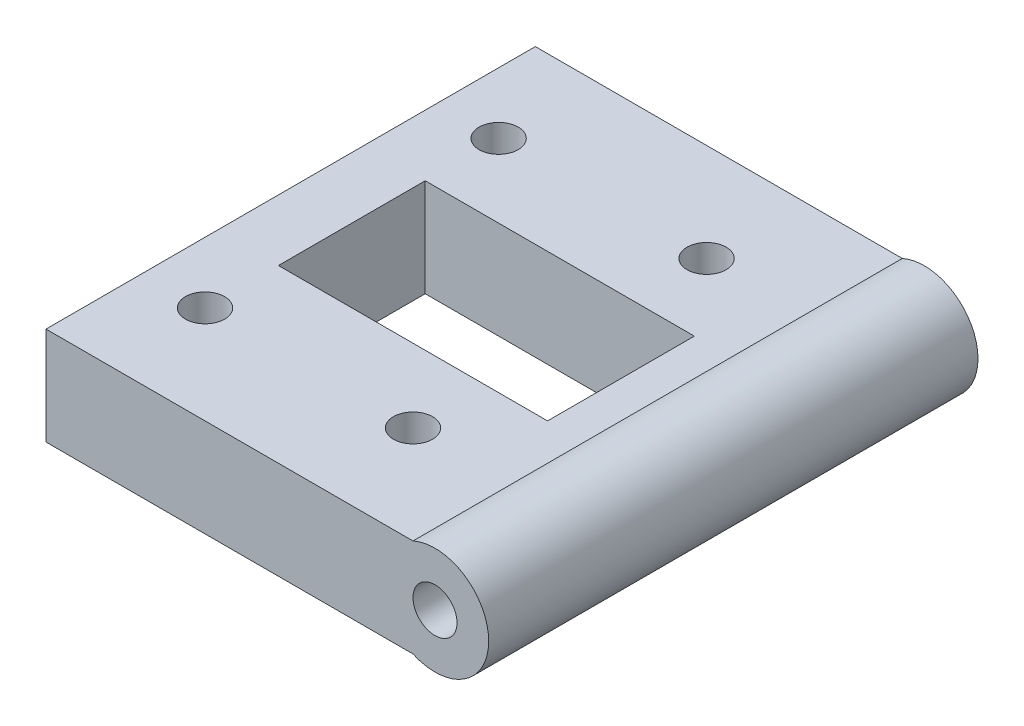
ISO-10303-21;
HEADER;
FILE_DESCRIPTION(('STEP AP214'),'2;1');
FILE_NAME('part.step','',(''),(''),'','','');
FILE_SCHEMA(('AUTOMOTIVE_DESIGN { 1 0 10303 214 1 1 1 1 }'));
ENDSEC;
DATA;
#1=APPLICATION_CONTEXT('core data for automotive mechanical design processes');
#2=APPLICATION_PROTOCOL_DEFINITION('international standard','automotive_design',2000,#1);
#3=PRODUCT_CONTEXT('',#1,'mechanical');
#4=PRODUCT('Part','Part','',(#3));
#5=PRODUCT_RELATED_PRODUCT_CATEGORY('part','',(#4));
#6=PRODUCT_DEFINITION_FORMATION('','',#4);
#7=PRODUCT_DEFINITION_CONTEXT('part definition',#1,'design');
#8=PRODUCT_DEFINITION('design','',#6,#7);
#9=PRODUCT_DEFINITION_SHAPE('','',#8);
#10=(LENGTH_UNIT() NAMED_UNIT(*) SI_UNIT(.MILLI.,.METRE.));
#11=(NAMED_UNIT(*) PLANE_ANGLE_UNIT() SI_UNIT($,.RADIAN.));
#12=(NAMED_UNIT(*) SI_UNIT($,.STERADIAN.) SOLID_ANGLE_UNIT());
#13=UNCERTAINTY_MEASURE_WITH_UNIT(LENGTH_MEASURE(1.E-05),#10,'distance_accuracy_value','');
#14=(GEOMETRIC_REPRESENTATION_CONTEXT(3) GLOBAL_UNCERTAINTY_ASSIGNED_CONTEXT((#13)) GLOBAL_UNIT_ASSIGNED_CONTEXT((#10,
#11,#12)) REPRESENTATION_CONTEXT('',''));
#15=CARTESIAN_POINT('',(0.,0.,0.));
#16=DIRECTION('',(0.,0.,1.));
#17=DIRECTION('',(1.,0.,0.));
#18=AXIS2_PLACEMENT_3D('',#15,#16,#17);
#19=CARTESIAN_POINT('',(21.3694771601507,8.,22.0463712196421));
#20=DIRECTION('',(1.,0.,0.));
#21=DIRECTION('',(0.,0.,-1.));
#22=AXIS2_PLACEMENT_3D('',#19,#20,#21);
#23=PLANE('',#22);
#24=DIRECTION('',(0.,0.,1.));
#25=VECTOR('',#24,1.);
#26=CARTESIAN_POINT('',(21.3694771601507,0.,22.0463712196421));
#27=LINE('',#26,#25);
#28=CARTESIAN_POINT('',(21.3694771601507,0.,-17.9536287803579));
#29=VERTEX_POINT('',#28);
#30=CARTESIAN_POINT('',(21.3694771601507,0.,22.0463712196421));
#31=VERTEX_POINT('',#30);
#32=EDGE_CURVE('E173',#29,#31,#27,.T.);
#33=ORIENTED_EDGE('',*,*,#32,.T.);
#34=DIRECTION('',(0.,-1.,0.));
#35=VECTOR('',#34,1.);
#36=CARTESIAN_POINT('',(21.3694771601507,8.,22.0463712196421));
#37=LINE('',#36,#35);
#38=CARTESIAN_POINT('',(21.3694771601507,8.,22.0463712196421));
#39=VERTEX_POINT('',#38);
#40=EDGE_CURVE('E207',#39,#31,#37,.T.);
#41=ORIENTED_EDGE('',*,*,#40,.F.);
#42=DIRECTION('',(0.,0.,1.));
#43=VECTOR('',#42,1.);
#44=CARTESIAN_POINT('',(21.3694771601507,8.,22.0463712196421));
#45=LINE('',#44,#43);
#46=CARTESIAN_POINT('',(21.3694771601507,8.,-17.9536287803579));
#47=VERTEX_POINT('',#46);
#48=EDGE_CURVE('E177',#47,#39,#45,.T.);
#49=ORIENTED_EDGE('',*,*,#48,.F.);
#50=DIRECTION('',(0.,-1.,0.));
#51=VECTOR('',#50,1.);
#52=CARTESIAN_POINT('',(21.3694771601507,8.,-17.9536287803579));
#53=LINE('',#52,#51);
#54=EDGE_CURVE('E191',#47,#29,#53,.T.);
#55=ORIENTED_EDGE('',*,*,#54,.T.);
#56=EDGE_LOOP('',(#33,#41,#49,#55));
#57=FACE_BOUND('',#56,.T.);
#58=ADVANCED_FACE('F42',(#57),#23,.F.);
#59=CARTESIAN_POINT('',(51.3694771601507,8.,22.0463712196421));
#60=DIRECTION('',(0.,0.,-1.));
#61=DIRECTION('',(-1.,0.,0.));
#62=AXIS2_PLACEMENT_3D('',#59,#60,#61);
#63=PLANE('',#62);
#64=DIRECTION('',(1.,0.,0.));
#65=VECTOR('',#64,1.);
#66=CARTESIAN_POINT('',(51.3694771601507,0.,22.0463712196421));
#67=LINE('',#66,#65);
#68=CARTESIAN_POINT('',(51.3694771601507,0.,22.0463712196421));
#69=VERTEX_POINT('',#68);
#70=EDGE_CURVE('E195',#31,#69,#67,.T.);
#71=ORIENTED_EDGE('',*,*,#70,.T.);
#72=CARTESIAN_POINT('',(53.1694771601507,4.,22.0463712196421));
#73=DIRECTION('',(0.,0.,1.));
#74=DIRECTION('',(1.,0.,0.));
#75=AXIS2_PLACEMENT_3D('',#72,#73,#74);
#76=CIRCLE('',#75,4.38634243989227);
#77=CARTESIAN_POINT('',(51.3694771601507,8.,22.0463712196421));
#78=VERTEX_POINT('',#77);
#79=EDGE_CURVE('E163',#69,#78,#76,.T.);
#80=ORIENTED_EDGE('',*,*,#79,.T.);
#81=DIRECTION('',(1.,0.,0.));
#82=VECTOR('',#81,1.);
#83=CARTESIAN_POINT('',(51.3694771601507,8.,22.0463712196421));
#84=LINE('',#83,#82);
#85=EDGE_CURVE('E181',#39,#78,#84,.T.);
#86=ORIENTED_EDGE('',*,*,#85,.F.);
#87=ORIENTED_EDGE('',*,*,#40,.T.);
#88=EDGE_LOOP('',(#71,#80,#86,#87));
#89=FACE_BOUND('',#88,.T.);
#90=CARTESIAN_POINT('',(53.1694771601507,4.,22.0463712196421));
#91=DIRECTION('',(0.,0.,1.));
#92=DIRECTION('',(1.,0.,0.));
#93=AXIS2_PLACEMENT_3D('',#90,#91,#92);
#94=CIRCLE('',#93,1.8);
#95=CARTESIAN_POINT('',(54.9694771601507,4.,22.0463712196421));
#96=VERTEX_POINT('',#95);
#97=EDGE_CURVE('E164',#96,#96,#94,.T.);
#98=ORIENTED_EDGE('',*,*,#97,.F.);
#99=EDGE_LOOP('',(#98));
#100=FACE_BOUND('',#99,.T.);
#101=ADVANCED_FACE('F252',(#89,#100),#63,.F.);
#102=CARTESIAN_POINT('',(51.3694771601507,8.,-17.9536287803579));
#103=DIRECTION('',(0.,0.,1.));
#104=DIRECTION('',(1.,0.,0.));
#105=AXIS2_PLACEMENT_3D('',#102,#103,#104);
#106=PLANE('',#105);
#107=CARTESIAN_POINT('',(53.1694771601507,4.,-17.9536287803579));
#108=DIRECTION('',(0.,0.,1.));
#109=DIRECTION('',(1.,0.,0.));
#110=AXIS2_PLACEMENT_3D('',#107,#108,#109);
#111=CIRCLE('',#110,1.8);
#112=CARTESIAN_POINT('',(54.9694771601507,4.,-17.9536287803579));
#113=VERTEX_POINT('',#112);
#114=EDGE_CURVE('E159',#113,#113,#111,.T.);
#115=ORIENTED_EDGE('',*,*,#114,.T.);
#116=EDGE_LOOP('',(#115));
#117=FACE_BOUND('',#116,.T.);
#118=DIRECTION('',(-1.,0.,0.));
#119=VECTOR('',#118,1.);
#120=CARTESIAN_POINT('',(51.3694771601507,8.,-17.9536287803579));
#121=LINE('',#120,#119);
#122=CARTESIAN_POINT('',(51.3694771601507,8.,-17.9536287803579));
#123=VERTEX_POINT('',#122);
#124=EDGE_CURVE('E188',#123,#47,#121,.T.);
#125=ORIENTED_EDGE('',*,*,#124,.F.);
#126=CARTESIAN_POINT('',(53.1694771601507,4.,-17.9536287803579));
#127=DIRECTION('',(0.,0.,1.));
#128=DIRECTION('',(1.,0.,0.));
#129=AXIS2_PLACEMENT_3D('',#126,#127,#128);
#130=CIRCLE('',#129,4.38634243989227);
#131=CARTESIAN_POINT('',(51.3694771601507,0.,-17.9536287803579));
#132=VERTEX_POINT('',#131);
#133=EDGE_CURVE('E169',#132,#123,#130,.T.);
#134=ORIENTED_EDGE('',*,*,#133,.F.);
#135=DIRECTION('',(-1.,0.,0.));
#136=VECTOR('',#135,1.);
#137=CARTESIAN_POINT('',(51.3694771601507,0.,-17.9536287803579));
#138=LINE('',#137,#136);
#139=EDGE_CURVE('E182',#132,#29,#138,.T.);
#140=ORIENTED_EDGE('',*,*,#139,.T.);
#141=ORIENTED_EDGE('',*,*,#54,.F.);
#142=EDGE_LOOP('',(#125,#134,#140,#141));
#143=FACE_BOUND('',#142,.T.);
#144=ADVANCED_FACE('F257',(#117,#143),#106,.F.);
#145=CARTESIAN_POINT('',(0.,8.,0.));
#146=DIRECTION('',(0.,1.,0.));
#147=DIRECTION('',(0.,0.,1.));
#148=AXIS2_PLACEMENT_3D('',#145,#146,#147);
#149=PLANE('',#148);
#150=DIRECTION('',(0.,0.,1.));
#151=VECTOR('',#150,1.);
#152=CARTESIAN_POINT('',(26.3694771601507,8.,8.04637121964206));
#153=LINE('',#152,#151);
#154=CARTESIAN_POINT('',(26.3694771601507,8.,-3.95362878035794));
#155=VERTEX_POINT('',#154);
#156=CARTESIAN_POINT('',(26.3694771601507,8.,8.04637121964206));
#157=VERTEX_POINT('',#156);
#158=EDGE_CURVE('E57',#155,#157,#153,.T.);
#159=ORIENTED_EDGE('',*,*,#158,.F.);
#160=DIRECTION('',(-1.,0.,0.));
#161=VECTOR('',#160,1.);
#162=CARTESIAN_POINT('',(48.3694771601507,8.,-3.95362878035794));
#163=LINE('',#162,#161);
#164=CARTESIAN_POINT('',(48.3694771601507,8.,-3.95362878035794));
#165=VERTEX_POINT('',#164);
#166=EDGE_CURVE('E128',#165,#155,#163,.T.);
#167=ORIENTED_EDGE('',*,*,#166,.F.);
#168=DIRECTION('',(0.,0.,-1.));
#169=VECTOR('',#168,1.);
#170=CARTESIAN_POINT('',(48.3694771601507,8.,8.04637121964206));
#171=LINE('',#170,#169);
#172=CARTESIAN_POINT('',(48.3694771601507,8.,8.04637121964206));
#173=VERTEX_POINT('',#172);
#174=EDGE_CURVE('E110',#173,#165,#171,.T.);
#175=ORIENTED_EDGE('',*,*,#174,.F.);
#176=DIRECTION('',(1.,0.,0.));
#177=VECTOR('',#176,1.);
#178=CARTESIAN_POINT('',(48.3694771601507,8.,8.04637121964206));
#179=LINE('',#178,#177);
#180=EDGE_CURVE('E120',#157,#173,#179,.T.);
#181=ORIENTED_EDGE('',*,*,#180,.F.);
#182=EDGE_LOOP('',(#159,#167,#175,#181));
#183=FACE_BOUND('',#182,.T.);
#184=CARTESIAN_POINT('',(26.3694771601507,8.,14.0463712196421));
#185=DIRECTION('',(0.,1.,0.));
#186=DIRECTION('',(0.,0.,-1.));
#187=AXIS2_PLACEMENT_3D('',#184,#185,#186);
#188=CIRCLE('',#187,1.60000000000001);
#189=CARTESIAN_POINT('',(26.3694771601507,8.,12.4463712196421));
#190=VERTEX_POINT('',#189);
#191=EDGE_CURVE('E138',#190,#190,#188,.T.);
#192=ORIENTED_EDGE('',*,*,#191,.F.);
#193=EDGE_LOOP('',(#192));
#194=FACE_BOUND('',#193,.T.);
#195=CARTESIAN_POINT('',(43.3694771601507,8.,14.0463712196421));
#196=DIRECTION('',(0.,1.,0.));
#197=DIRECTION('',(0.,0.,-1.));
#198=AXIS2_PLACEMENT_3D('',#195,#196,#197);
#199=CIRCLE('',#198,1.6);
#200=CARTESIAN_POINT('',(43.3694771601507,8.,12.4463712196421));
#201=VERTEX_POINT('',#200);
#202=EDGE_CURVE('E148',#201,#201,#199,.T.);
#203=ORIENTED_EDGE('',*,*,#202,.F.);
#204=EDGE_LOOP('',(#203));
#205=FACE_BOUND('',#204,.T.);
#206=CARTESIAN_POINT('',(43.3694771601507,8.,-9.95362878035793));
#207=DIRECTION('',(0.,1.,0.));
#208=DIRECTION('',(0.,0.,1.));
#209=AXIS2_PLACEMENT_3D('',#206,#207,#208);
#210=CIRCLE('',#209,1.6);
#211=CARTESIAN_POINT('',(43.3694771601507,8.,-8.35362878035794));
#212=VERTEX_POINT('',#211);
#213=EDGE_CURVE('E143',#212,#212,#210,.T.);
#214=ORIENTED_EDGE('',*,*,#213,.F.);
#215=EDGE_LOOP('',(#214));
#216=FACE_BOUND('',#215,.T.);
#217=CARTESIAN_POINT('',(26.3694771601507,8.,-9.95362878035793));
#218=DIRECTION('',(0.,1.,0.));
#219=DIRECTION('',(0.,0.,1.));
#220=AXIS2_PLACEMENT_3D('',#217,#218,#219);
#221=CIRCLE('',#220,1.6);
#222=CARTESIAN_POINT('',(26.3694771601507,8.,-8.35362878035793));
#223=VERTEX_POINT('',#222);
#224=EDGE_CURVE('E147',#223,#223,#221,.T.);
#225=ORIENTED_EDGE('',*,*,#224,.F.);
#226=EDGE_LOOP('',(#225));
#227=FACE_BOUND('',#226,.T.);
#228=ORIENTED_EDGE('',*,*,#48,.T.);
#229=ORIENTED_EDGE('',*,*,#85,.T.);
#230=DIRECTION('',(0.,0.,-1.));
#231=VECTOR('',#230,1.);
#232=CARTESIAN_POINT('',(51.3694771601507,8.,22.0463712196421));
#233=LINE('',#232,#231);
#234=EDGE_CURVE('E185',#78,#123,#233,.T.);
#235=ORIENTED_EDGE('',*,*,#234,.T.);
#236=ORIENTED_EDGE('',*,*,#124,.T.);
#237=EDGE_LOOP('',(#228,#229,#235,#236));
#238=FACE_BOUND('',#237,.T.);
#239=ADVANCED_FACE('F125',(#183,#194,#205,#216,#227,#238),#149,.T.);
#240=CARTESIAN_POINT('',(0.,0.,0.));
#241=DIRECTION('',(0.,1.,0.));
#242=DIRECTION('',(0.,0.,1.));
#243=AXIS2_PLACEMENT_3D('',#240,#241,#242);
#244=PLANE('',#243);
#245=DIRECTION('',(-1.,0.,0.));
#246=VECTOR('',#245,1.);
#247=CARTESIAN_POINT('',(0.,0.,-3.95362878035794));
#248=LINE('',#247,#246);
#249=CARTESIAN_POINT('',(48.3694771601507,0.,-3.95362878035794));
#250=VERTEX_POINT('',#249);
#251=CARTESIAN_POINT('',(26.3694771601507,0.,-3.95362878035794));
#252=VERTEX_POINT('',#251);
#253=EDGE_CURVE('E50',#250,#252,#248,.T.);
#254=ORIENTED_EDGE('',*,*,#253,.T.);
#255=DIRECTION('',(0.,0.,1.));
#256=VECTOR('',#255,1.);
#257=CARTESIAN_POINT('',(26.3694771601507,0.,0.));
#258=LINE('',#257,#256);
#259=CARTESIAN_POINT('',(26.3694771601507,0.,8.04637121964206));
#260=VERTEX_POINT('',#259);
#261=EDGE_CURVE('E11',#252,#260,#258,.T.);
#262=ORIENTED_EDGE('',*,*,#261,.T.);
#263=DIRECTION('',(1.,0.,0.));
#264=VECTOR('',#263,1.);
#265=CARTESIAN_POINT('',(0.,0.,8.04637121964207));
#266=LINE('',#265,#264);
#267=CARTESIAN_POINT('',(48.3694771601507,0.,8.04637121964206));
#268=VERTEX_POINT('',#267);
#269=EDGE_CURVE('E211',#260,#268,#266,.T.);
#270=ORIENTED_EDGE('',*,*,#269,.T.);
#271=DIRECTION('',(0.,0.,-1.));
#272=VECTOR('',#271,1.);
#273=CARTESIAN_POINT('',(48.3694771601507,0.,0.));
#274=LINE('',#273,#272);
#275=EDGE_CURVE('E113',#268,#250,#274,.T.);
#276=ORIENTED_EDGE('',*,*,#275,.T.);
#277=EDGE_LOOP('',(#254,#262,#270,#276));
#278=FACE_BOUND('',#277,.T.);
#279=CARTESIAN_POINT('',(26.3694771601507,0.,14.0463712196421));
#280=DIRECTION('',(0.,1.,0.));
#281=DIRECTION('',(0.,0.,1.));
#282=AXIS2_PLACEMENT_3D('',#279,#280,#281);
#283=CIRCLE('',#282,1.60000000000001);
#284=CARTESIAN_POINT('',(26.3694771601507,0.,15.6463712196421));
#285=VERTEX_POINT('',#284);
#286=EDGE_CURVE('E168',#285,#285,#283,.T.);
#287=ORIENTED_EDGE('',*,*,#286,.T.);
#288=EDGE_LOOP('',(#287));
#289=FACE_BOUND('',#288,.T.);
#290=CARTESIAN_POINT('',(43.3694771601507,0.,14.0463712196421));
#291=DIRECTION('',(0.,1.,0.));
#292=DIRECTION('',(0.,0.,1.));
#293=AXIS2_PLACEMENT_3D('',#290,#291,#292);
#294=CIRCLE('',#293,1.6);
#295=CARTESIAN_POINT('',(43.3694771601507,0.,15.6463712196421));
#296=VERTEX_POINT('',#295);
#297=EDGE_CURVE('E219',#296,#296,#294,.T.);
#298=ORIENTED_EDGE('',*,*,#297,.T.);
#299=EDGE_LOOP('',(#298));
#300=FACE_BOUND('',#299,.T.);
#301=CARTESIAN_POINT('',(43.3694771601507,0.,-9.95362878035793));
#302=DIRECTION('',(0.,1.,0.));
#303=DIRECTION('',(0.,0.,1.));
#304=AXIS2_PLACEMENT_3D('',#301,#302,#303);
#305=CIRCLE('',#304,1.6);
#306=CARTESIAN_POINT('',(43.3694771601507,0.,-8.35362878035794));
#307=VERTEX_POINT('',#306);
#308=EDGE_CURVE('E215',#307,#307,#305,.T.);
#309=ORIENTED_EDGE('',*,*,#308,.T.);
#310=EDGE_LOOP('',(#309));
#311=FACE_BOUND('',#310,.T.);
#312=CARTESIAN_POINT('',(26.3694771601507,0.,-9.95362878035793));
#313=DIRECTION('',(0.,1.,0.));
#314=DIRECTION('',(0.,0.,1.));
#315=AXIS2_PLACEMENT_3D('',#312,#313,#314);
#316=CIRCLE('',#315,1.6);
#317=CARTESIAN_POINT('',(26.3694771601507,0.,-8.35362878035793));
#318=VERTEX_POINT('',#317);
#319=EDGE_CURVE('E158',#318,#318,#316,.T.);
#320=ORIENTED_EDGE('',*,*,#319,.T.);
#321=EDGE_LOOP('',(#320));
#322=FACE_BOUND('',#321,.T.);
#323=ORIENTED_EDGE('',*,*,#32,.F.);
#324=ORIENTED_EDGE('',*,*,#139,.F.);
#325=DIRECTION('',(0.,0.,-1.));
#326=VECTOR('',#325,1.);
#327=CARTESIAN_POINT('',(51.3694771601507,0.,22.0463712196421));
#328=LINE('',#327,#326);
#329=EDGE_CURVE('E198',#69,#132,#328,.T.);
#330=ORIENTED_EDGE('',*,*,#329,.F.);
#331=ORIENTED_EDGE('',*,*,#70,.F.);
#332=EDGE_LOOP('',(#323,#324,#330,#331));
#333=FACE_BOUND('',#332,.T.);
#334=ADVANCED_FACE('F232',(#278,#289,#300,#311,#322,#333),#244,.F.);
#335=CARTESIAN_POINT('',(53.1694771601507,4.,-17.9536287803579));
#336=DIRECTION('',(0.,0.,1.));
#337=DIRECTION('',(1.,0.,0.));
#338=AXIS2_PLACEMENT_3D('',#335,#336,#337);
#339=CYLINDRICAL_SURFACE('',#338,4.38634243989227);
#340=ORIENTED_EDGE('',*,*,#133,.T.);
#341=ORIENTED_EDGE('',*,*,#234,.F.);
#342=ORIENTED_EDGE('',*,*,#79,.F.);
#343=ORIENTED_EDGE('',*,*,#329,.T.);
#344=EDGE_LOOP('',(#340,#341,#342,#343));
#345=FACE_BOUND('',#344,.T.);
#346=ADVANCED_FACE('F273',(#345),#339,.T.);
#347=CARTESIAN_POINT('',(53.1694771601507,4.,-17.9536287803579));
#348=DIRECTION('',(0.,0.,1.));
#349=DIRECTION('',(1.,0.,0.));
#350=AXIS2_PLACEMENT_3D('',#347,#348,#349);
#351=CYLINDRICAL_SURFACE('',#350,1.8);
#352=ORIENTED_EDGE('',*,*,#97,.T.);
#353=EDGE_LOOP('',(#352));
#354=FACE_BOUND('',#353,.T.);
#355=ORIENTED_EDGE('',*,*,#114,.F.);
#356=EDGE_LOOP('',(#355));
#357=FACE_BOUND('',#356,.T.);
#358=ADVANCED_FACE('F275',(#354,#357),#351,.F.);
#359=CARTESIAN_POINT('',(26.3694771601507,-0.386342439892266,-9.95362878035793));
#360=DIRECTION('',(0.,1.,0.));
#361=DIRECTION('',(0.,0.,1.));
#362=AXIS2_PLACEMENT_3D('',#359,#360,#361);
#363=CYLINDRICAL_SURFACE('',#362,1.6);
#364=ORIENTED_EDGE('',*,*,#224,.T.);
#365=EDGE_LOOP('',(#364));
#366=FACE_BOUND('',#365,.T.);
#367=ORIENTED_EDGE('',*,*,#319,.F.);
#368=EDGE_LOOP('',(#367));
#369=FACE_BOUND('',#368,.T.);
#370=ADVANCED_FACE('F281',(#366,#369),#363,.F.);
#371=CARTESIAN_POINT('',(43.3694771601507,-0.386342439892266,-9.95362878035793));
#372=DIRECTION('',(0.,1.,0.));
#373=DIRECTION('',(0.,0.,1.));
#374=AXIS2_PLACEMENT_3D('',#371,#372,#373);
#375=CYLINDRICAL_SURFACE('',#374,1.6);
#376=ORIENTED_EDGE('',*,*,#213,.T.);
#377=EDGE_LOOP('',(#376));
#378=FACE_BOUND('',#377,.T.);
#379=ORIENTED_EDGE('',*,*,#308,.F.);
#380=EDGE_LOOP('',(#379));
#381=FACE_BOUND('',#380,.T.);
#382=ADVANCED_FACE('F359',(#378,#381),#375,.F.);
#383=CARTESIAN_POINT('',(43.3694771601507,-0.386342439892266,14.0463712196421));
#384=DIRECTION('',(0.,1.,0.));
#385=DIRECTION('',(0.,0.,1.));
#386=AXIS2_PLACEMENT_3D('',#383,#384,#385);
#387=CYLINDRICAL_SURFACE('',#386,1.6);
#388=ORIENTED_EDGE('',*,*,#202,.T.);
#389=EDGE_LOOP('',(#388));
#390=FACE_BOUND('',#389,.T.);
#391=ORIENTED_EDGE('',*,*,#297,.F.);
#392=EDGE_LOOP('',(#391));
#393=FACE_BOUND('',#392,.T.);
#394=ADVANCED_FACE('F246',(#390,#393),#387,.F.);
#395=CARTESIAN_POINT('',(26.3694771601507,-0.386342439892266,14.0463712196421));
#396=DIRECTION('',(0.,1.,0.));
#397=DIRECTION('',(0.,0.,1.));
#398=AXIS2_PLACEMENT_3D('',#395,#396,#397);
#399=CYLINDRICAL_SURFACE('',#398,1.60000000000001);
#400=ORIENTED_EDGE('',*,*,#191,.T.);
#401=EDGE_LOOP('',(#400));
#402=FACE_BOUND('',#401,.T.);
#403=ORIENTED_EDGE('',*,*,#286,.F.);
#404=EDGE_LOOP('',(#403));
#405=FACE_BOUND('',#404,.T.);
#406=ADVANCED_FACE('F239',(#402,#405),#399,.F.);
#407=CARTESIAN_POINT('',(26.3694771601507,-0.386342439892266,8.04637121964206));
#408=DIRECTION('',(-1.,0.,0.));
#409=DIRECTION('',(0.,0.,1.));
#410=AXIS2_PLACEMENT_3D('',#407,#408,#409);
#411=PLANE('',#410);
#412=DIRECTION('',(0.,1.,0.));
#413=VECTOR('',#412,1.);
#414=CARTESIAN_POINT('',(26.3694771601507,-0.386342439892266,-3.95362878035794));
#415=LINE('',#414,#413);
#416=EDGE_CURVE('E135',#252,#155,#415,.T.);
#417=ORIENTED_EDGE('',*,*,#416,.T.);
#418=ORIENTED_EDGE('',*,*,#158,.T.);
#419=DIRECTION('',(0.,1.,0.));
#420=VECTOR('',#419,1.);
#421=CARTESIAN_POINT('',(26.3694771601507,-0.386342439892266,8.04637121964206));
#422=LINE('',#421,#420);
#423=EDGE_CURVE('E117',#260,#157,#422,.T.);
#424=ORIENTED_EDGE('',*,*,#423,.F.);
#425=ORIENTED_EDGE('',*,*,#261,.F.);
#426=EDGE_LOOP('',(#417,#418,#424,#425));
#427=FACE_BOUND('',#426,.T.);
#428=ADVANCED_FACE('F237',(#427),#411,.F.);
#429=CARTESIAN_POINT('',(48.3694771601507,-0.386342439892266,-3.95362878035794));
#430=DIRECTION('',(0.,0.,-1.));
#431=DIRECTION('',(-1.,0.,0.));
#432=AXIS2_PLACEMENT_3D('',#429,#430,#431);
#433=PLANE('',#432);
#434=DIRECTION('',(0.,1.,0.));
#435=VECTOR('',#434,1.);
#436=CARTESIAN_POINT('',(48.3694771601507,-0.386342439892266,-3.95362878035794));
#437=LINE('',#436,#435);
#438=EDGE_CURVE('E116',#250,#165,#437,.T.);
#439=ORIENTED_EDGE('',*,*,#438,.T.);
#440=ORIENTED_EDGE('',*,*,#166,.T.);
#441=ORIENTED_EDGE('',*,*,#416,.F.);
#442=ORIENTED_EDGE('',*,*,#253,.F.);
#443=EDGE_LOOP('',(#439,#440,#441,#442));
#444=FACE_BOUND('',#443,.T.);
#445=ADVANCED_FACE('F236',(#444),#433,.F.);
#446=CARTESIAN_POINT('',(48.3694771601507,-0.386342439892266,8.04637121964206));
#447=DIRECTION('',(1.,0.,0.));
#448=DIRECTION('',(0.,0.,-1.));
#449=AXIS2_PLACEMENT_3D('',#446,#447,#448);
#450=PLANE('',#449);
#451=DIRECTION('',(0.,1.,0.));
#452=VECTOR('',#451,1.);
#453=CARTESIAN_POINT('',(48.3694771601507,-0.386342439892266,8.04637121964206));
#454=LINE('',#453,#452);
#455=EDGE_CURVE('E65',#268,#173,#454,.T.);
#456=ORIENTED_EDGE('',*,*,#455,.T.);
#457=ORIENTED_EDGE('',*,*,#174,.T.);
#458=ORIENTED_EDGE('',*,*,#438,.F.);
#459=ORIENTED_EDGE('',*,*,#275,.F.);
#460=EDGE_LOOP('',(#456,#457,#458,#459));
#461=FACE_BOUND('',#460,.T.);
#462=ADVANCED_FACE('F107',(#461),#450,.F.);
#463=CARTESIAN_POINT('',(48.3694771601507,-0.386342439892266,8.04637121964206));
#464=DIRECTION('',(0.,0.,1.));
#465=DIRECTION('',(1.,0.,0.));
#466=AXIS2_PLACEMENT_3D('',#463,#464,#465);
#467=PLANE('',#466);
#468=ORIENTED_EDGE('',*,*,#423,.T.);
#469=ORIENTED_EDGE('',*,*,#180,.T.);
#470=ORIENTED_EDGE('',*,*,#455,.F.);
#471=ORIENTED_EDGE('',*,*,#269,.F.);
#472=EDGE_LOOP('',(#468,#469,#470,#471));
#473=FACE_BOUND('',#472,.T.);
#474=ADVANCED_FACE('F121',(#473),#467,.F.);
#475=CLOSED_SHELL('',(#58,#101,#144,#239,#334,#346,#358,#370,#382,#394,#406,#428,#445,#462,#474));
#476=MANIFOLD_SOLID_BREP('B2',#475);
#477=ADVANCED_BREP_SHAPE_REPRESENTATION('',(#18,#476),#14);
#478=SHAPE_DEFINITION_REPRESENTATION(#9,#477);
ENDSEC;
END-ISO-10303-21;
